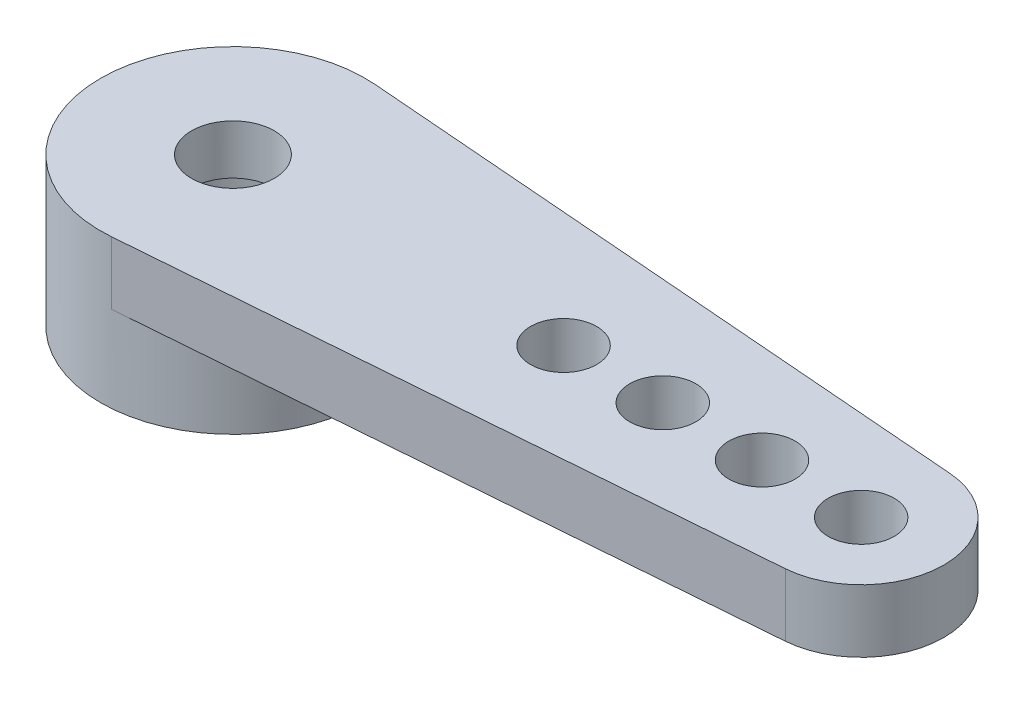
ISO-10303-21;
HEADER;
FILE_DESCRIPTION(('STEP AP214'),'2;1');
FILE_NAME('part.step','',(''),(''),'','','');
FILE_SCHEMA(('AUTOMOTIVE_DESIGN { 1 0 10303 214 1 1 1 1 }'));
ENDSEC;
DATA;
#1=APPLICATION_CONTEXT('core data for automotive mechanical design processes');
#2=APPLICATION_PROTOCOL_DEFINITION('international standard','automotive_design',2000,#1);
#3=PRODUCT_CONTEXT('',#1,'mechanical');
#4=PRODUCT('Part','Part','',(#3));
#5=PRODUCT_RELATED_PRODUCT_CATEGORY('part','',(#4));
#6=PRODUCT_DEFINITION_FORMATION('','',#4);
#7=PRODUCT_DEFINITION_CONTEXT('part definition',#1,'design');
#8=PRODUCT_DEFINITION('design','',#6,#7);
#9=PRODUCT_DEFINITION_SHAPE('','',#8);
#10=(LENGTH_UNIT() NAMED_UNIT(*) SI_UNIT(.MILLI.,.METRE.));
#11=(NAMED_UNIT(*) PLANE_ANGLE_UNIT() SI_UNIT($,.RADIAN.));
#12=(NAMED_UNIT(*) SI_UNIT($,.STERADIAN.) SOLID_ANGLE_UNIT());
#13=UNCERTAINTY_MEASURE_WITH_UNIT(LENGTH_MEASURE(1.E-05),#10,'distance_accuracy_value','');
#14=(GEOMETRIC_REPRESENTATION_CONTEXT(3) GLOBAL_UNCERTAINTY_ASSIGNED_CONTEXT((#13)) GLOBAL_UNIT_ASSIGNED_CONTEXT((#10,
#11,#12)) REPRESENTATION_CONTEXT('',''));
#15=CARTESIAN_POINT('',(0.,0.,0.));
#16=DIRECTION('',(0.,0.,1.));
#17=DIRECTION('',(1.,0.,0.));
#18=AXIS2_PLACEMENT_3D('',#15,#16,#17);
#19=CARTESIAN_POINT('',(0.,4.5,0.));
#20=DIRECTION('',(0.,-1.,0.));
#21=DIRECTION('',(0.,0.,-1.));
#22=AXIS2_PLACEMENT_3D('',#19,#20,#21);
#23=CYLINDRICAL_SURFACE('',#22,1.25);
#24=CARTESIAN_POINT('',(0.,4.5,0.));
#25=DIRECTION('',(0.,1.,0.));
#26=DIRECTION('',(0.,0.,1.));
#27=AXIS2_PLACEMENT_3D('',#24,#25,#26);
#28=CIRCLE('',#27,1.25);
#29=CARTESIAN_POINT('',(0.,4.5,1.25));
#30=VERTEX_POINT('',#29);
#31=EDGE_CURVE('E112',#30,#30,#28,.T.);
#32=ORIENTED_EDGE('',*,*,#31,.T.);
#33=EDGE_LOOP('',(#32));
#34=FACE_BOUND('',#33,.T.);
#35=CARTESIAN_POINT('',(0.,3.,0.));
#36=DIRECTION('',(0.,-1.,0.));
#37=DIRECTION('',(0.,0.,-1.));
#38=AXIS2_PLACEMENT_3D('',#35,#36,#37);
#39=CIRCLE('',#38,1.25);
#40=CARTESIAN_POINT('',(0.,3.,-1.25));
#41=VERTEX_POINT('',#40);
#42=EDGE_CURVE('E47',#41,#41,#39,.T.);
#43=ORIENTED_EDGE('',*,*,#42,.T.);
#44=EDGE_LOOP('',(#43));
#45=FACE_BOUND('',#44,.T.);
#46=ADVANCED_FACE('F43',(#34,#45),#23,.F.);
#47=CARTESIAN_POINT('',(0.,4.5,0.));
#48=DIRECTION('',(0.,-1.,0.));
#49=DIRECTION('',(0.,0.,-1.));
#50=AXIS2_PLACEMENT_3D('',#47,#48,#49);
#51=CYLINDRICAL_SURFACE('',#50,4.);
#52=CARTESIAN_POINT('',(0.,0.,0.));
#53=DIRECTION('',(0.,1.,0.));
#54=DIRECTION('',(0.,0.,1.));
#55=AXIS2_PLACEMENT_3D('',#52,#53,#54);
#56=CIRCLE('',#55,4.);
#57=CARTESIAN_POINT('',(0.,0.,4.));
#58=VERTEX_POINT('',#57);
#59=EDGE_CURVE('E52',#58,#58,#56,.T.);
#60=ORIENTED_EDGE('',*,*,#59,.T.);
#61=EDGE_LOOP('',(#60));
#62=FACE_BOUND('',#61,.T.);
#63=DIRECTION('',(0.,1.,0.));
#64=VECTOR('',#63,1.);
#65=CARTESIAN_POINT('',(0.315789473684211,2.6,3.98751514207912));
#66=LINE('',#65,#64);
#67=CARTESIAN_POINT('',(0.315789473684211,2.6,3.98751514207912));
#68=VERTEX_POINT('',#67);
#69=CARTESIAN_POINT('',(0.315789473684211,4.5,3.98751514207912));
#70=VERTEX_POINT('',#69);
#71=EDGE_CURVE('E105',#68,#70,#66,.T.);
#72=ORIENTED_EDGE('',*,*,#71,.T.);
#73=CARTESIAN_POINT('',(0.,4.5,0.));
#74=DIRECTION('',(0.,1.,0.));
#75=DIRECTION('',(0.,0.,1.));
#76=AXIS2_PLACEMENT_3D('',#73,#74,#75);
#77=CIRCLE('',#76,4.);
#78=CARTESIAN_POINT('',(0.315789473684211,4.5,-3.98751514207912));
#79=VERTEX_POINT('',#78);
#80=EDGE_CURVE('E11',#79,#70,#77,.T.);
#81=ORIENTED_EDGE('',*,*,#80,.F.);
#82=DIRECTION('',(0.,1.,0.));
#83=VECTOR('',#82,1.);
#84=CARTESIAN_POINT('',(0.315789473684211,2.6,-3.98751514207912));
#85=LINE('',#84,#83);
#86=CARTESIAN_POINT('',(0.315789473684211,2.6,-3.98751514207912));
#87=VERTEX_POINT('',#86);
#88=EDGE_CURVE('E60',#87,#79,#85,.T.);
#89=ORIENTED_EDGE('',*,*,#88,.F.);
#90=CARTESIAN_POINT('',(0.,2.6,0.));
#91=DIRECTION('',(0.,1.,0.));
#92=DIRECTION('',(0.,0.,1.));
#93=AXIS2_PLACEMENT_3D('',#90,#91,#92);
#94=CIRCLE('',#93,4.);
#95=EDGE_CURVE('E93',#68,#87,#94,.T.);
#96=ORIENTED_EDGE('',*,*,#95,.F.);
#97=EDGE_LOOP('',(#72,#81,#89,#96));
#98=FACE_BOUND('',#97,.T.);
#99=ADVANCED_FACE('F45',(#62,#98),#51,.T.);
#100=CARTESIAN_POINT('',(0.,4.5,0.));
#101=DIRECTION('',(0.,1.,0.));
#102=DIRECTION('',(0.,0.,1.));
#103=AXIS2_PLACEMENT_3D('',#100,#101,#102);
#104=PLANE('',#103);
#105=ORIENTED_EDGE('',*,*,#80,.T.);
#106=DIRECTION('',(0.99687878551978,0.,-0.0789473684210528));
#107=VECTOR('',#106,1.);
#108=CARTESIAN_POINT('',(0.315789473684211,4.5,3.98751514207912));
#109=LINE('',#108,#107);
#110=CARTESIAN_POINT('',(19.1973684210526,4.5,2.49219696379945));
#111=VERTEX_POINT('',#110);
#112=EDGE_CURVE('E208',#70,#111,#109,.T.);
#113=ORIENTED_EDGE('',*,*,#112,.T.);
#114=CARTESIAN_POINT('',(19.,4.5,0.));
#115=DIRECTION('',(0.,1.,0.));
#116=DIRECTION('',(0.,0.,1.));
#117=AXIS2_PLACEMENT_3D('',#114,#115,#116);
#118=CIRCLE('',#117,2.5);
#119=CARTESIAN_POINT('',(19.1973684210526,4.5,-2.49219696379945));
#120=VERTEX_POINT('',#119);
#121=EDGE_CURVE('E203',#111,#120,#118,.T.);
#122=ORIENTED_EDGE('',*,*,#121,.T.);
#123=DIRECTION('',(0.99687878551978,0.,0.0789473684210528));
#124=VECTOR('',#123,1.);
#125=CARTESIAN_POINT('',(0.315789473684211,4.5,-3.98751514207912));
#126=LINE('',#125,#124);
#127=EDGE_CURVE('E206',#79,#120,#126,.T.);
#128=ORIENTED_EDGE('',*,*,#127,.F.);
#129=EDGE_LOOP('',(#105,#113,#122,#128));
#130=FACE_BOUND('',#129,.T.);
#131=ORIENTED_EDGE('',*,*,#31,.F.);
#132=EDGE_LOOP('',(#131));
#133=FACE_BOUND('',#132,.T.);
#134=CARTESIAN_POINT('',(16.,4.5,0.));
#135=DIRECTION('',(0.,1.,0.));
#136=DIRECTION('',(0.,0.,1.));
#137=AXIS2_PLACEMENT_3D('',#134,#135,#136);
#138=CIRCLE('',#137,1.);
#139=CARTESIAN_POINT('',(16.,4.5,1.));
#140=VERTEX_POINT('',#139);
#141=EDGE_CURVE('E180',#140,#140,#138,.T.);
#142=ORIENTED_EDGE('',*,*,#141,.F.);
#143=EDGE_LOOP('',(#142));
#144=FACE_BOUND('',#143,.T.);
#145=CARTESIAN_POINT('',(10.,4.5,0.));
#146=DIRECTION('',(0.,1.,0.));
#147=DIRECTION('',(0.,0.,1.));
#148=AXIS2_PLACEMENT_3D('',#145,#146,#147);
#149=CIRCLE('',#148,1.);
#150=CARTESIAN_POINT('',(10.,4.5,1.));
#151=VERTEX_POINT('',#150);
#152=EDGE_CURVE('E200',#151,#151,#149,.T.);
#153=ORIENTED_EDGE('',*,*,#152,.F.);
#154=EDGE_LOOP('',(#153));
#155=FACE_BOUND('',#154,.T.);
#156=CARTESIAN_POINT('',(13.,4.5,0.));
#157=DIRECTION('',(0.,1.,0.));
#158=DIRECTION('',(0.,0.,1.));
#159=AXIS2_PLACEMENT_3D('',#156,#157,#158);
#160=CIRCLE('',#159,1.);
#161=CARTESIAN_POINT('',(13.,4.5,1.));
#162=VERTEX_POINT('',#161);
#163=EDGE_CURVE('E211',#162,#162,#160,.T.);
#164=ORIENTED_EDGE('',*,*,#163,.F.);
#165=EDGE_LOOP('',(#164));
#166=FACE_BOUND('',#165,.T.);
#167=CARTESIAN_POINT('',(19.,4.5,0.));
#168=DIRECTION('',(0.,1.,0.));
#169=DIRECTION('',(0.,0.,1.));
#170=AXIS2_PLACEMENT_3D('',#167,#168,#169);
#171=CIRCLE('',#170,1.);
#172=CARTESIAN_POINT('',(19.,4.5,1.));
#173=VERTEX_POINT('',#172);
#174=EDGE_CURVE('E188',#173,#173,#171,.T.);
#175=ORIENTED_EDGE('',*,*,#174,.F.);
#176=EDGE_LOOP('',(#175));
#177=FACE_BOUND('',#176,.T.);
#178=ADVANCED_FACE('F121',(#130,#133,#144,#155,#166,#177),#104,.T.);
#179=CARTESIAN_POINT('',(0.,0.,0.));
#180=DIRECTION('',(0.,1.,0.));
#181=DIRECTION('',(0.,0.,1.));
#182=AXIS2_PLACEMENT_3D('',#179,#180,#181);
#183=PLANE('',#182);
#184=CARTESIAN_POINT('',(0.,0.,0.));
#185=DIRECTION('',(0.,-1.,0.));
#186=DIRECTION('',(0.,0.,-1.));
#187=AXIS2_PLACEMENT_3D('',#184,#185,#186);
#188=CIRCLE('',#187,2.4);
#189=CARTESIAN_POINT('',(0.,0.,-2.4));
#190=VERTEX_POINT('',#189);
#191=EDGE_CURVE('E178',#190,#190,#188,.T.);
#192=ORIENTED_EDGE('',*,*,#191,.F.);
#193=EDGE_LOOP('',(#192));
#194=FACE_BOUND('',#193,.T.);
#195=ORIENTED_EDGE('',*,*,#59,.F.);
#196=EDGE_LOOP('',(#195));
#197=FACE_BOUND('',#196,.T.);
#198=ADVANCED_FACE('F118',(#194,#197),#183,.F.);
#199=CARTESIAN_POINT('',(19.,2.6,0.));
#200=DIRECTION('',(0.,1.,0.));
#201=DIRECTION('',(0.,0.,1.));
#202=AXIS2_PLACEMENT_3D('',#199,#200,#201);
#203=CYLINDRICAL_SURFACE('',#202,2.5);
#204=ORIENTED_EDGE('',*,*,#121,.F.);
#205=DIRECTION('',(0.,1.,0.));
#206=VECTOR('',#205,1.);
#207=CARTESIAN_POINT('',(19.1973684210526,2.6,2.49219696379945));
#208=LINE('',#207,#206);
#209=CARTESIAN_POINT('',(19.1973684210526,2.6,2.49219696379945));
#210=VERTEX_POINT('',#209);
#211=EDGE_CURVE('E69',#210,#111,#208,.T.);
#212=ORIENTED_EDGE('',*,*,#211,.F.);
#213=CARTESIAN_POINT('',(19.,2.6,0.));
#214=DIRECTION('',(0.,1.,0.));
#215=DIRECTION('',(0.,0.,1.));
#216=AXIS2_PLACEMENT_3D('',#213,#214,#215);
#217=CIRCLE('',#216,2.5);
#218=CARTESIAN_POINT('',(19.1973684210526,2.6,-2.49219696379945));
#219=VERTEX_POINT('',#218);
#220=EDGE_CURVE('E94',#210,#219,#217,.T.);
#221=ORIENTED_EDGE('',*,*,#220,.T.);
#222=DIRECTION('',(0.,1.,0.));
#223=VECTOR('',#222,1.);
#224=CARTESIAN_POINT('',(19.1973684210526,2.6,-2.49219696379945));
#225=LINE('',#224,#223);
#226=EDGE_CURVE('E92',#219,#120,#225,.T.);
#227=ORIENTED_EDGE('',*,*,#226,.T.);
#228=EDGE_LOOP('',(#204,#212,#221,#227));
#229=FACE_BOUND('',#228,.T.);
#230=ADVANCED_FACE('F120',(#229),#203,.T.);
#231=CARTESIAN_POINT('',(0.315789473684211,2.6,3.98751514207912));
#232=DIRECTION('',(0.0789473684210528,0.,0.996878785519779));
#233=DIRECTION('',(0.99687878551978,0.,-0.0789473684210528));
#234=AXIS2_PLACEMENT_3D('',#231,#232,#233);
#235=PLANE('',#234);
#236=ORIENTED_EDGE('',*,*,#112,.F.);
#237=ORIENTED_EDGE('',*,*,#71,.F.);
#238=DIRECTION('',(0.99687878551978,0.,-0.0789473684210528));
#239=VECTOR('',#238,1.);
#240=CARTESIAN_POINT('',(0.315789473684211,2.6,3.98751514207912));
#241=LINE('',#240,#239);
#242=EDGE_CURVE('E100',#68,#210,#241,.T.);
#243=ORIENTED_EDGE('',*,*,#242,.T.);
#244=ORIENTED_EDGE('',*,*,#211,.T.);
#245=EDGE_LOOP('',(#236,#237,#243,#244));
#246=FACE_BOUND('',#245,.T.);
#247=ADVANCED_FACE('F128',(#246),#235,.T.);
#248=CARTESIAN_POINT('',(13.,2.6,0.));
#249=DIRECTION('',(0.,1.,0.));
#250=DIRECTION('',(0.,0.,1.));
#251=AXIS2_PLACEMENT_3D('',#248,#249,#250);
#252=CYLINDRICAL_SURFACE('',#251,1.);
#253=CARTESIAN_POINT('',(13.,2.6,0.));
#254=DIRECTION('',(0.,1.,0.));
#255=DIRECTION('',(0.,0.,1.));
#256=AXIS2_PLACEMENT_3D('',#253,#254,#255);
#257=CIRCLE('',#256,1.);
#258=CARTESIAN_POINT('',(13.,2.6,1.));
#259=VERTEX_POINT('',#258);
#260=EDGE_CURVE('E193',#259,#259,#257,.T.);
#261=ORIENTED_EDGE('',*,*,#260,.F.);
#262=EDGE_LOOP('',(#261));
#263=FACE_BOUND('',#262,.T.);
#264=ORIENTED_EDGE('',*,*,#163,.T.);
#265=EDGE_LOOP('',(#264));
#266=FACE_BOUND('',#265,.T.);
#267=ADVANCED_FACE('F153',(#263,#266),#252,.F.);
#268=CARTESIAN_POINT('',(0.315789473684211,2.6,-3.98751514207912));
#269=DIRECTION('',(-0.0789473684210528,0.,0.996878785519779));
#270=DIRECTION('',(0.99687878551978,0.,0.0789473684210528));
#271=AXIS2_PLACEMENT_3D('',#268,#269,#270);
#272=PLANE('',#271);
#273=ORIENTED_EDGE('',*,*,#127,.T.);
#274=ORIENTED_EDGE('',*,*,#226,.F.);
#275=DIRECTION('',(0.99687878551978,0.,0.0789473684210528));
#276=VECTOR('',#275,1.);
#277=CARTESIAN_POINT('',(0.315789473684211,2.6,-3.98751514207912));
#278=LINE('',#277,#276);
#279=EDGE_CURVE('E89',#87,#219,#278,.T.);
#280=ORIENTED_EDGE('',*,*,#279,.F.);
#281=ORIENTED_EDGE('',*,*,#88,.T.);
#282=EDGE_LOOP('',(#273,#274,#280,#281));
#283=FACE_BOUND('',#282,.T.);
#284=ADVANCED_FACE('F91',(#283),#272,.F.);
#285=CARTESIAN_POINT('',(10.,2.6,0.));
#286=DIRECTION('',(0.,1.,0.));
#287=DIRECTION('',(0.,0.,1.));
#288=AXIS2_PLACEMENT_3D('',#285,#286,#287);
#289=CYLINDRICAL_SURFACE('',#288,1.);
#290=CARTESIAN_POINT('',(10.,2.6,0.));
#291=DIRECTION('',(0.,1.,0.));
#292=DIRECTION('',(0.,0.,1.));
#293=AXIS2_PLACEMENT_3D('',#290,#291,#292);
#294=CIRCLE('',#293,1.);
#295=CARTESIAN_POINT('',(10.,2.6,1.));
#296=VERTEX_POINT('',#295);
#297=EDGE_CURVE('E187',#296,#296,#294,.T.);
#298=ORIENTED_EDGE('',*,*,#297,.F.);
#299=EDGE_LOOP('',(#298));
#300=FACE_BOUND('',#299,.T.);
#301=ORIENTED_EDGE('',*,*,#152,.T.);
#302=EDGE_LOOP('',(#301));
#303=FACE_BOUND('',#302,.T.);
#304=ADVANCED_FACE('F146',(#300,#303),#289,.F.);
#305=CARTESIAN_POINT('',(16.,2.6,0.));
#306=DIRECTION('',(0.,1.,0.));
#307=DIRECTION('',(0.,0.,1.));
#308=AXIS2_PLACEMENT_3D('',#305,#306,#307);
#309=CYLINDRICAL_SURFACE('',#308,1.);
#310=CARTESIAN_POINT('',(16.,2.6,0.));
#311=DIRECTION('',(0.,1.,0.));
#312=DIRECTION('',(0.,0.,1.));
#313=AXIS2_PLACEMENT_3D('',#310,#311,#312);
#314=CIRCLE('',#313,1.);
#315=CARTESIAN_POINT('',(16.,2.6,1.));
#316=VERTEX_POINT('',#315);
#317=EDGE_CURVE('E184',#316,#316,#314,.T.);
#318=ORIENTED_EDGE('',*,*,#317,.F.);
#319=EDGE_LOOP('',(#318));
#320=FACE_BOUND('',#319,.T.);
#321=ORIENTED_EDGE('',*,*,#141,.T.);
#322=EDGE_LOOP('',(#321));
#323=FACE_BOUND('',#322,.T.);
#324=ADVANCED_FACE('F142',(#320,#323),#309,.F.);
#325=CARTESIAN_POINT('',(19.,2.6,0.));
#326=DIRECTION('',(0.,1.,0.));
#327=DIRECTION('',(0.,0.,1.));
#328=AXIS2_PLACEMENT_3D('',#325,#326,#327);
#329=CYLINDRICAL_SURFACE('',#328,1.);
#330=CARTESIAN_POINT('',(19.,2.6,0.));
#331=DIRECTION('',(0.,1.,0.));
#332=DIRECTION('',(0.,0.,1.));
#333=AXIS2_PLACEMENT_3D('',#330,#331,#332);
#334=CIRCLE('',#333,1.);
#335=CARTESIAN_POINT('',(19.,2.6,1.));
#336=VERTEX_POINT('',#335);
#337=EDGE_CURVE('E108',#336,#336,#334,.T.);
#338=ORIENTED_EDGE('',*,*,#337,.F.);
#339=EDGE_LOOP('',(#338));
#340=FACE_BOUND('',#339,.T.);
#341=ORIENTED_EDGE('',*,*,#174,.T.);
#342=EDGE_LOOP('',(#341));
#343=FACE_BOUND('',#342,.T.);
#344=ADVANCED_FACE('F145',(#340,#343),#329,.F.);
#345=CARTESIAN_POINT('',(0.,2.6,0.));
#346=DIRECTION('',(0.,1.,0.));
#347=DIRECTION('',(0.,0.,1.));
#348=AXIS2_PLACEMENT_3D('',#345,#346,#347);
#349=PLANE('',#348);
#350=ORIENTED_EDGE('',*,*,#317,.T.);
#351=EDGE_LOOP('',(#350));
#352=FACE_BOUND('',#351,.T.);
#353=ORIENTED_EDGE('',*,*,#297,.T.);
#354=EDGE_LOOP('',(#353));
#355=FACE_BOUND('',#354,.T.);
#356=ORIENTED_EDGE('',*,*,#220,.F.);
#357=ORIENTED_EDGE('',*,*,#242,.F.);
#358=ORIENTED_EDGE('',*,*,#95,.T.);
#359=ORIENTED_EDGE('',*,*,#279,.T.);
#360=EDGE_LOOP('',(#356,#357,#358,#359));
#361=FACE_BOUND('',#360,.T.);
#362=ORIENTED_EDGE('',*,*,#260,.T.);
#363=EDGE_LOOP('',(#362));
#364=FACE_BOUND('',#363,.T.);
#365=ORIENTED_EDGE('',*,*,#337,.T.);
#366=EDGE_LOOP('',(#365));
#367=FACE_BOUND('',#366,.T.);
#368=ADVANCED_FACE('F98',(#352,#355,#361,#364,#367),#349,.F.);
#369=CARTESIAN_POINT('',(0.,3.,0.));
#370=DIRECTION('',(0.,-1.,0.));
#371=DIRECTION('',(0.,0.,-1.));
#372=AXIS2_PLACEMENT_3D('',#369,#370,#371);
#373=CYLINDRICAL_SURFACE('',#372,2.4);
#374=CARTESIAN_POINT('',(0.,3.,0.));
#375=DIRECTION('',(0.,-1.,0.));
#376=DIRECTION('',(0.,0.,-1.));
#377=AXIS2_PLACEMENT_3D('',#374,#375,#376);
#378=CIRCLE('',#377,2.4);
#379=CARTESIAN_POINT('',(0.,3.,-2.4));
#380=VERTEX_POINT('',#379);
#381=EDGE_CURVE('E177',#380,#380,#378,.T.);
#382=ORIENTED_EDGE('',*,*,#381,.F.);
#383=EDGE_LOOP('',(#382));
#384=FACE_BOUND('',#383,.T.);
#385=ORIENTED_EDGE('',*,*,#191,.T.);
#386=EDGE_LOOP('',(#385));
#387=FACE_BOUND('',#386,.T.);
#388=ADVANCED_FACE('F163',(#384,#387),#373,.F.);
#389=CARTESIAN_POINT('',(0.,3.,0.));
#390=DIRECTION('',(0.,-1.,0.));
#391=DIRECTION('',(0.,0.,-1.));
#392=AXIS2_PLACEMENT_3D('',#389,#390,#391);
#393=PLANE('',#392);
#394=ORIENTED_EDGE('',*,*,#42,.F.);
#395=EDGE_LOOP('',(#394));
#396=FACE_BOUND('',#395,.T.);
#397=ORIENTED_EDGE('',*,*,#381,.T.);
#398=EDGE_LOOP('',(#397));
#399=FACE_BOUND('',#398,.T.);
#400=ADVANCED_FACE('F166',(#396,#399),#393,.T.);
#401=CLOSED_SHELL('',(#46,#99,#178,#198,#230,#247,#267,#284,#304,#324,#344,#368,#388,#400));
#402=MANIFOLD_SOLID_BREP('B2',#401);
#403=ADVANCED_BREP_SHAPE_REPRESENTATION('',(#18,#402),#14);
#404=SHAPE_DEFINITION_REPRESENTATION(#9,#403);
ENDSEC;
END-ISO-10303-21;
